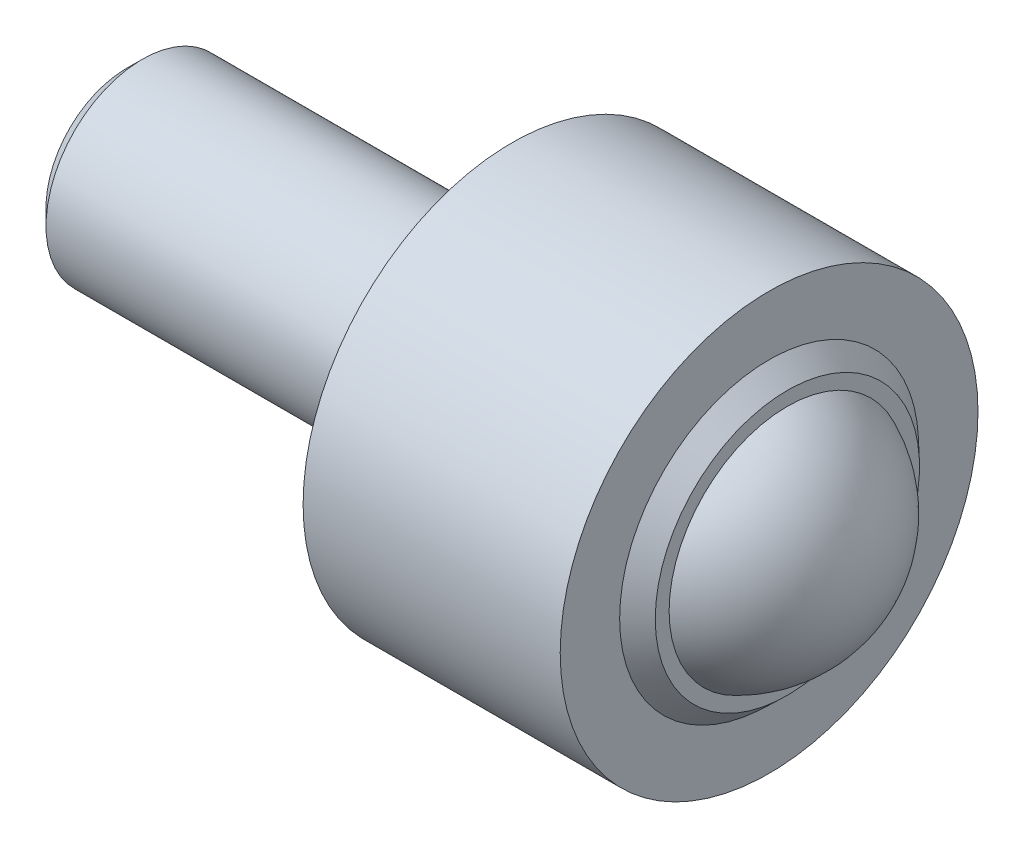
ISO-10303-21;
HEADER;
FILE_DESCRIPTION(('STEP AP214'),'2;1');
FILE_NAME('part.step','',(''),(''),'','','');
FILE_SCHEMA(('AUTOMOTIVE_DESIGN { 1 0 10303 214 1 1 1 1 }'));
ENDSEC;
DATA;
#1=APPLICATION_CONTEXT('core data for automotive mechanical design processes');
#2=APPLICATION_PROTOCOL_DEFINITION('international standard','automotive_design',2000,#1);
#3=PRODUCT_CONTEXT('',#1,'mechanical');
#4=PRODUCT('Part','Part','',(#3));
#5=PRODUCT_RELATED_PRODUCT_CATEGORY('part','',(#4));
#6=PRODUCT_DEFINITION_FORMATION('','',#4);
#7=PRODUCT_DEFINITION_CONTEXT('part definition',#1,'design');
#8=PRODUCT_DEFINITION('design','',#6,#7);
#9=PRODUCT_DEFINITION_SHAPE('','',#8);
#10=(LENGTH_UNIT() NAMED_UNIT(*) SI_UNIT(.MILLI.,.METRE.));
#11=(NAMED_UNIT(*) PLANE_ANGLE_UNIT() SI_UNIT($,.RADIAN.));
#12=(NAMED_UNIT(*) SI_UNIT($,.STERADIAN.) SOLID_ANGLE_UNIT());
#13=UNCERTAINTY_MEASURE_WITH_UNIT(LENGTH_MEASURE(1.E-05),#10,'distance_accuracy_value','');
#14=(GEOMETRIC_REPRESENTATION_CONTEXT(3) GLOBAL_UNCERTAINTY_ASSIGNED_CONTEXT((#13)) GLOBAL_UNIT_ASSIGNED_CONTEXT((#10,
#11,#12)) REPRESENTATION_CONTEXT('',''));
#15=CARTESIAN_POINT('',(0.,0.,0.));
#16=DIRECTION('',(0.,0.,1.));
#17=DIRECTION('',(1.,0.,0.));
#18=AXIS2_PLACEMENT_3D('',#15,#16,#17);
#19=CARTESIAN_POINT('',(12.,0.,0.));
#20=DIRECTION('',(-1.,0.,0.));
#21=DIRECTION('',(0.,0.,1.));
#22=AXIS2_PLACEMENT_3D('',#19,#20,#21);
#23=CYLINDRICAL_SURFACE('',#22,3.);
#24=CARTESIAN_POINT('',(0.5,0.,0.));
#25=DIRECTION('',(1.,0.,0.));
#26=DIRECTION('',(0.,0.,-1.));
#27=AXIS2_PLACEMENT_3D('',#24,#25,#26);
#28=CIRCLE('',#27,3.);
#29=CARTESIAN_POINT('',(0.5,0.,-3.));
#30=VERTEX_POINT('',#29);
#31=EDGE_CURVE('E39',#30,#30,#28,.T.);
#32=ORIENTED_EDGE('',*,*,#31,.T.);
#33=EDGE_LOOP('',(#32));
#34=FACE_BOUND('',#33,.T.);
#35=CARTESIAN_POINT('',(12.,0.,0.));
#36=DIRECTION('',(1.,0.,0.));
#37=DIRECTION('',(0.,0.,-1.));
#38=AXIS2_PLACEMENT_3D('',#35,#36,#37);
#39=CIRCLE('',#38,3.);
#40=CARTESIAN_POINT('',(12.,0.,-3.));
#41=VERTEX_POINT('',#40);
#42=EDGE_CURVE('E43',#41,#41,#39,.T.);
#43=ORIENTED_EDGE('',*,*,#42,.F.);
#44=EDGE_LOOP('',(#43));
#45=FACE_BOUND('',#44,.T.);
#46=ADVANCED_FACE('F32',(#34,#45),#23,.T.);
#47=CARTESIAN_POINT('',(0.,0.,0.));
#48=DIRECTION('',(1.,0.,0.));
#49=DIRECTION('',(0.,0.,-1.));
#50=AXIS2_PLACEMENT_3D('',#47,#48,#49);
#51=PLANE('',#50);
#52=CARTESIAN_POINT('',(0.,0.,0.));
#53=DIRECTION('',(1.,0.,0.));
#54=DIRECTION('',(0.,0.,-1.));
#55=AXIS2_PLACEMENT_3D('',#52,#53,#54);
#56=CIRCLE('',#55,2.5);
#57=CARTESIAN_POINT('',(0.,0.,-2.5));
#58=VERTEX_POINT('',#57);
#59=EDGE_CURVE('E10',#58,#58,#56,.F.);
#60=ORIENTED_EDGE('',*,*,#59,.T.);
#61=EDGE_LOOP('',(#60));
#62=FACE_BOUND('',#61,.T.);
#63=ADVANCED_FACE('F91',(#62),#51,.F.);
#64=CARTESIAN_POINT('',(20.,0.,0.));
#65=DIRECTION('',(-1.,0.,0.));
#66=DIRECTION('',(0.,0.,1.));
#67=AXIS2_PLACEMENT_3D('',#64,#65,#66);
#68=CYLINDRICAL_SURFACE('',#67,6.5);
#69=CARTESIAN_POINT('',(20.,0.,0.));
#70=DIRECTION('',(1.,0.,0.));
#71=DIRECTION('',(0.,0.,-1.));
#72=AXIS2_PLACEMENT_3D('',#69,#70,#71);
#73=CIRCLE('',#72,6.5);
#74=CARTESIAN_POINT('',(20.,0.,-6.5));
#75=VERTEX_POINT('',#74);
#76=EDGE_CURVE('E47',#75,#75,#73,.T.);
#77=ORIENTED_EDGE('',*,*,#76,.F.);
#78=EDGE_LOOP('',(#77));
#79=FACE_BOUND('',#78,.T.);
#80=CARTESIAN_POINT('',(12.,0.,0.));
#81=DIRECTION('',(1.,0.,0.));
#82=DIRECTION('',(0.,0.,-1.));
#83=AXIS2_PLACEMENT_3D('',#80,#81,#82);
#84=CIRCLE('',#83,6.5);
#85=CARTESIAN_POINT('',(12.,0.,-6.5));
#86=VERTEX_POINT('',#85);
#87=EDGE_CURVE('E50',#86,#86,#84,.T.);
#88=ORIENTED_EDGE('',*,*,#87,.T.);
#89=EDGE_LOOP('',(#88));
#90=FACE_BOUND('',#89,.T.);
#91=ADVANCED_FACE('F95',(#79,#90),#68,.T.);
#92=CARTESIAN_POINT('',(20.,0.,0.));
#93=DIRECTION('',(1.,0.,0.));
#94=DIRECTION('',(0.,0.,-1.));
#95=AXIS2_PLACEMENT_3D('',#92,#93,#94);
#96=PLANE('',#95);
#97=CARTESIAN_POINT('',(20.,0.,0.));
#98=DIRECTION('',(-1.,0.,0.));
#99=DIRECTION('',(0.,0.,1.));
#100=AXIS2_PLACEMENT_3D('',#97,#98,#99);
#101=CIRCLE('',#100,4.65086537431426);
#102=CARTESIAN_POINT('',(20.,0.,4.65086537431426));
#103=VERTEX_POINT('',#102);
#104=EDGE_CURVE('E61',#103,#103,#101,.T.);
#105=ORIENTED_EDGE('',*,*,#104,.T.);
#106=EDGE_LOOP('',(#105));
#107=FACE_BOUND('',#106,.T.);
#108=ORIENTED_EDGE('',*,*,#76,.T.);
#109=EDGE_LOOP('',(#108));
#110=FACE_BOUND('',#109,.T.);
#111=ADVANCED_FACE('F65',(#107,#110),#96,.T.);
#112=CARTESIAN_POINT('',(12.,0.,0.));
#113=DIRECTION('',(1.,0.,0.));
#114=DIRECTION('',(0.,0.,-1.));
#115=AXIS2_PLACEMENT_3D('',#112,#113,#114);
#116=PLANE('',#115);
#117=ORIENTED_EDGE('',*,*,#42,.T.);
#118=EDGE_LOOP('',(#117));
#119=FACE_BOUND('',#118,.T.);
#120=ORIENTED_EDGE('',*,*,#87,.F.);
#121=EDGE_LOOP('',(#120));
#122=FACE_BOUND('',#121,.T.);
#123=ADVANCED_FACE('F82',(#119,#122),#116,.F.);
#124=CARTESIAN_POINT('',(19.,0.,0.));
#125=DIRECTION('',(-1.,0.,0.));
#126=DIRECTION('',(0.,0.,1.));
#127=AXIS2_PLACEMENT_3D('',#124,#125,#126);
#128=SPHERICAL_SURFACE('',#127,4.);
#129=CARTESIAN_POINT('',(20.5681338920704,0.,0.));
#130=DIRECTION('',(-1.,0.,0.));
#131=DIRECTION('',(0.,0.,1.));
#132=AXIS2_PLACEMENT_3D('',#129,#130,#131);
#133=CIRCLE('',#132,3.6798038122351);
#134=CARTESIAN_POINT('',(20.5681338920704,0.,3.6798038122351));
#135=VERTEX_POINT('',#134);
#136=EDGE_CURVE('E53',#135,#135,#133,.T.);
#137=ORIENTED_EDGE('',*,*,#136,.F.);
#138=EDGE_LOOP('',(#137));
#139=FACE_BOUND('',#138,.T.);
#140=ADVANCED_FACE('F77',(#139),#128,.T.);
#141=CARTESIAN_POINT('',(20.5681338920704,0.,-4.11099415781164));
#142=DIRECTION('',(-1.,0.,0.));
#143=DIRECTION('',(0.,0.,1.));
#144=AXIS2_PLACEMENT_3D('',#141,#142,#143);
#145=PLANE('',#144);
#146=CARTESIAN_POINT('',(20.5681338920704,0.,0.));
#147=DIRECTION('',(-1.,0.,0.));
#148=DIRECTION('',(0.,0.,1.));
#149=AXIS2_PLACEMENT_3D('',#146,#147,#148);
#150=CIRCLE('',#149,4.11099415781164);
#151=CARTESIAN_POINT('',(20.5681338920704,0.,4.11099415781164));
#152=VERTEX_POINT('',#151);
#153=EDGE_CURVE('E58',#152,#152,#150,.T.);
#154=ORIENTED_EDGE('',*,*,#153,.F.);
#155=EDGE_LOOP('',(#154));
#156=FACE_BOUND('',#155,.T.);
#157=ORIENTED_EDGE('',*,*,#136,.T.);
#158=EDGE_LOOP('',(#157));
#159=FACE_BOUND('',#158,.T.);
#160=ADVANCED_FACE('F71',(#156,#159),#145,.F.);
#161=CARTESIAN_POINT('',(20.5681338920704,0.,0.));
#162=DIRECTION('',(-1.,0.,0.));
#163=DIRECTION('',(0.,0.,1.));
#164=AXIS2_PLACEMENT_3D('',#161,#162,#163);
#165=CONICAL_SURFACE('',#164,4.11099415781164,0.759895981051894);
#166=ORIENTED_EDGE('',*,*,#104,.F.);
#167=EDGE_LOOP('',(#166));
#168=FACE_BOUND('',#167,.T.);
#169=ORIENTED_EDGE('',*,*,#153,.T.);
#170=EDGE_LOOP('',(#169));
#171=FACE_BOUND('',#170,.T.);
#172=ADVANCED_FACE('F68',(#168,#171),#165,.T.);
#173=CARTESIAN_POINT('',(0.5,0.,0.));
#174=DIRECTION('',(1.,0.,0.));
#175=DIRECTION('',(0.,0.,-1.));
#176=AXIS2_PLACEMENT_3D('',#173,#174,#175);
#177=CONICAL_SURFACE('',#176,3.,0.785398163397452);
#178=ORIENTED_EDGE('',*,*,#59,.F.);
#179=EDGE_LOOP('',(#178));
#180=FACE_BOUND('',#179,.T.);
#181=ORIENTED_EDGE('',*,*,#31,.F.);
#182=EDGE_LOOP('',(#181));
#183=FACE_BOUND('',#182,.T.);
#184=ADVANCED_FACE('F34',(#180,#183),#177,.T.);
#185=CLOSED_SHELL('',(#46,#63,#91,#111,#123,#140,#160,#172,#184));
#186=MANIFOLD_SOLID_BREP('B2',#185);
#187=ADVANCED_BREP_SHAPE_REPRESENTATION('',(#18,#186),#14);
#188=SHAPE_DEFINITION_REPRESENTATION(#9,#187);
ENDSEC;
END-ISO-10303-21;
